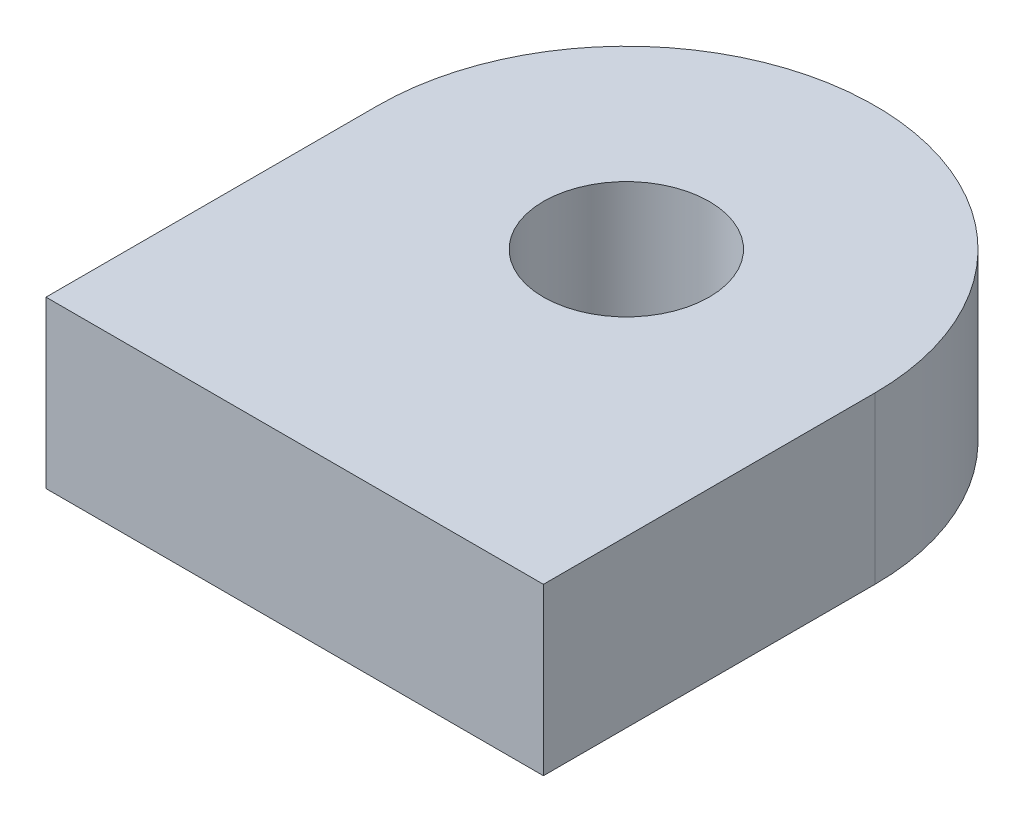
ISO-10303-21;
HEADER;
FILE_DESCRIPTION(('STEP AP214'),'2;1');
FILE_NAME('part.step','',(''),(''),'','','');
FILE_SCHEMA(('AUTOMOTIVE_DESIGN { 1 0 10303 214 1 1 1 1 }'));
ENDSEC;
DATA;
#1=APPLICATION_CONTEXT('core data for automotive mechanical design processes');
#2=APPLICATION_PROTOCOL_DEFINITION('international standard','automotive_design',2000,#1);
#3=PRODUCT_CONTEXT('',#1,'mechanical');
#4=PRODUCT('Part','Part','',(#3));
#5=PRODUCT_RELATED_PRODUCT_CATEGORY('part','',(#4));
#6=PRODUCT_DEFINITION_FORMATION('','',#4);
#7=PRODUCT_DEFINITION_CONTEXT('part definition',#1,'design');
#8=PRODUCT_DEFINITION('design','',#6,#7);
#9=PRODUCT_DEFINITION_SHAPE('','',#8);
#10=(LENGTH_UNIT() NAMED_UNIT(*) SI_UNIT(.MILLI.,.METRE.));
#11=(NAMED_UNIT(*) PLANE_ANGLE_UNIT() SI_UNIT($,.RADIAN.));
#12=(NAMED_UNIT(*) SI_UNIT($,.STERADIAN.) SOLID_ANGLE_UNIT());
#13=UNCERTAINTY_MEASURE_WITH_UNIT(LENGTH_MEASURE(1.E-05),#10,'distance_accuracy_value','');
#14=(GEOMETRIC_REPRESENTATION_CONTEXT(3) GLOBAL_UNCERTAINTY_ASSIGNED_CONTEXT((#13)) GLOBAL_UNIT_ASSIGNED_CONTEXT((#10,
#11,#12)) REPRESENTATION_CONTEXT('',''));
#15=CARTESIAN_POINT('',(0.,0.,0.));
#16=DIRECTION('',(0.,0.,1.));
#17=DIRECTION('',(1.,0.,0.));
#18=AXIS2_PLACEMENT_3D('',#15,#16,#17);
#19=CARTESIAN_POINT('',(0.,12.7,0.));
#20=DIRECTION('',(0.,1.,0.));
#21=DIRECTION('',(0.,0.,1.));
#22=AXIS2_PLACEMENT_3D('',#19,#20,#21);
#23=PLANE('',#22);
#24=CARTESIAN_POINT('',(0.,12.7,0.));
#25=DIRECTION('',(0.,1.,0.));
#26=DIRECTION('',(0.,0.,1.));
#27=AXIS2_PLACEMENT_3D('',#24,#25,#26);
#28=CIRCLE('',#27,19.05);
#29=CARTESIAN_POINT('',(19.05,12.7,0.));
#30=VERTEX_POINT('',#29);
#31=CARTESIAN_POINT('',(-19.05,12.7,0.));
#32=VERTEX_POINT('',#31);
#33=EDGE_CURVE('E86',#30,#32,#28,.T.);
#34=ORIENTED_EDGE('',*,*,#33,.T.);
#35=DIRECTION('',(0.,0.,1.));
#36=VECTOR('',#35,1.);
#37=CARTESIAN_POINT('',(-19.05,12.7,0.));
#38=LINE('',#37,#36);
#39=CARTESIAN_POINT('',(-19.05,12.7,25.4));
#40=VERTEX_POINT('',#39);
#41=EDGE_CURVE('E81',#32,#40,#38,.T.);
#42=ORIENTED_EDGE('',*,*,#41,.T.);
#43=DIRECTION('',(1.,0.,0.));
#44=VECTOR('',#43,1.);
#45=CARTESIAN_POINT('',(-19.05,12.7,25.4));
#46=LINE('',#45,#44);
#47=CARTESIAN_POINT('',(19.05,12.7,25.4));
#48=VERTEX_POINT('',#47);
#49=EDGE_CURVE('E84',#40,#48,#46,.T.);
#50=ORIENTED_EDGE('',*,*,#49,.T.);
#51=DIRECTION('',(0.,0.,-1.));
#52=VECTOR('',#51,1.);
#53=CARTESIAN_POINT('',(19.05,12.7,25.4));
#54=LINE('',#53,#52);
#55=EDGE_CURVE('E51',#48,#30,#54,.T.);
#56=ORIENTED_EDGE('',*,*,#55,.T.);
#57=EDGE_LOOP('',(#34,#42,#50,#56));
#58=FACE_BOUND('',#57,.T.);
#59=CARTESIAN_POINT('',(0.,12.7,0.));
#60=DIRECTION('',(0.,1.,0.));
#61=DIRECTION('',(0.,0.,1.));
#62=AXIS2_PLACEMENT_3D('',#59,#60,#61);
#63=CIRCLE('',#62,6.35);
#64=CARTESIAN_POINT('',(0.,12.7,6.35));
#65=VERTEX_POINT('',#64);
#66=EDGE_CURVE('E101',#65,#65,#63,.T.);
#67=ORIENTED_EDGE('',*,*,#66,.F.);
#68=EDGE_LOOP('',(#67));
#69=FACE_BOUND('',#68,.T.);
#70=ADVANCED_FACE('F34',(#58,#69),#23,.T.);
#71=CARTESIAN_POINT('',(0.,0.,0.));
#72=DIRECTION('',(0.,1.,0.));
#73=DIRECTION('',(0.,0.,1.));
#74=AXIS2_PLACEMENT_3D('',#71,#72,#73);
#75=PLANE('',#74);
#76=CARTESIAN_POINT('',(0.,0.,0.));
#77=DIRECTION('',(0.,1.,0.));
#78=DIRECTION('',(0.,0.,1.));
#79=AXIS2_PLACEMENT_3D('',#76,#77,#78);
#80=CIRCLE('',#79,19.05);
#81=CARTESIAN_POINT('',(19.05,0.,0.));
#82=VERTEX_POINT('',#81);
#83=CARTESIAN_POINT('',(-19.05,0.,0.));
#84=VERTEX_POINT('',#83);
#85=EDGE_CURVE('E98',#82,#84,#80,.T.);
#86=ORIENTED_EDGE('',*,*,#85,.F.);
#87=DIRECTION('',(0.,0.,-1.));
#88=VECTOR('',#87,1.);
#89=CARTESIAN_POINT('',(19.05,0.,25.4));
#90=LINE('',#89,#88);
#91=CARTESIAN_POINT('',(19.05,0.,25.4));
#92=VERTEX_POINT('',#91);
#93=EDGE_CURVE('E74',#92,#82,#90,.T.);
#94=ORIENTED_EDGE('',*,*,#93,.F.);
#95=DIRECTION('',(1.,0.,0.));
#96=VECTOR('',#95,1.);
#97=CARTESIAN_POINT('',(-19.05,0.,25.4));
#98=LINE('',#97,#96);
#99=CARTESIAN_POINT('',(-19.05,0.,25.4));
#100=VERTEX_POINT('',#99);
#101=EDGE_CURVE('E68',#100,#92,#98,.T.);
#102=ORIENTED_EDGE('',*,*,#101,.F.);
#103=DIRECTION('',(0.,0.,1.));
#104=VECTOR('',#103,1.);
#105=CARTESIAN_POINT('',(-19.05,0.,0.));
#106=LINE('',#105,#104);
#107=EDGE_CURVE('E90',#84,#100,#106,.T.);
#108=ORIENTED_EDGE('',*,*,#107,.F.);
#109=EDGE_LOOP('',(#86,#94,#102,#108));
#110=FACE_BOUND('',#109,.T.);
#111=CARTESIAN_POINT('',(0.,0.,0.));
#112=DIRECTION('',(0.,1.,0.));
#113=DIRECTION('',(0.,0.,1.));
#114=AXIS2_PLACEMENT_3D('',#111,#112,#113);
#115=CIRCLE('',#114,6.35);
#116=CARTESIAN_POINT('',(0.,0.,6.35));
#117=VERTEX_POINT('',#116);
#118=EDGE_CURVE('E113',#117,#117,#115,.T.);
#119=ORIENTED_EDGE('',*,*,#118,.T.);
#120=EDGE_LOOP('',(#119));
#121=FACE_BOUND('',#120,.T.);
#122=ADVANCED_FACE('F109',(#110,#121),#75,.F.);
#123=CARTESIAN_POINT('',(0.,12.7,0.));
#124=DIRECTION('',(0.,-1.,0.));
#125=DIRECTION('',(0.,0.,-1.));
#126=AXIS2_PLACEMENT_3D('',#123,#124,#125);
#127=CYLINDRICAL_SURFACE('',#126,19.05);
#128=ORIENTED_EDGE('',*,*,#85,.T.);
#129=DIRECTION('',(0.,-1.,0.));
#130=VECTOR('',#129,1.);
#131=CARTESIAN_POINT('',(-19.05,12.7,0.));
#132=LINE('',#131,#130);
#133=EDGE_CURVE('E11',#32,#84,#132,.T.);
#134=ORIENTED_EDGE('',*,*,#133,.F.);
#135=ORIENTED_EDGE('',*,*,#33,.F.);
#136=DIRECTION('',(0.,-1.,0.));
#137=VECTOR('',#136,1.);
#138=CARTESIAN_POINT('',(19.05,12.7,0.));
#139=LINE('',#138,#137);
#140=EDGE_CURVE('E94',#30,#82,#139,.T.);
#141=ORIENTED_EDGE('',*,*,#140,.T.);
#142=EDGE_LOOP('',(#128,#134,#135,#141));
#143=FACE_BOUND('',#142,.T.);
#144=ADVANCED_FACE('F36',(#143),#127,.T.);
#145=CARTESIAN_POINT('',(-19.05,12.7,0.));
#146=DIRECTION('',(1.,0.,0.));
#147=DIRECTION('',(0.,0.,-1.));
#148=AXIS2_PLACEMENT_3D('',#145,#146,#147);
#149=PLANE('',#148);
#150=ORIENTED_EDGE('',*,*,#107,.T.);
#151=DIRECTION('',(0.,-1.,0.));
#152=VECTOR('',#151,1.);
#153=CARTESIAN_POINT('',(-19.05,12.7,25.4));
#154=LINE('',#153,#152);
#155=EDGE_CURVE('E43',#40,#100,#154,.T.);
#156=ORIENTED_EDGE('',*,*,#155,.F.);
#157=ORIENTED_EDGE('',*,*,#41,.F.);
#158=ORIENTED_EDGE('',*,*,#133,.T.);
#159=EDGE_LOOP('',(#150,#156,#157,#158));
#160=FACE_BOUND('',#159,.T.);
#161=ADVANCED_FACE('F89',(#160),#149,.F.);
#162=CARTESIAN_POINT('',(-19.05,12.7,25.4));
#163=DIRECTION('',(0.,0.,-1.));
#164=DIRECTION('',(-1.,0.,0.));
#165=AXIS2_PLACEMENT_3D('',#162,#163,#164);
#166=PLANE('',#165);
#167=ORIENTED_EDGE('',*,*,#101,.T.);
#168=DIRECTION('',(0.,-1.,0.));
#169=VECTOR('',#168,1.);
#170=CARTESIAN_POINT('',(19.05,12.7,25.4));
#171=LINE('',#170,#169);
#172=EDGE_CURVE('E91',#48,#92,#171,.T.);
#173=ORIENTED_EDGE('',*,*,#172,.F.);
#174=ORIENTED_EDGE('',*,*,#49,.F.);
#175=ORIENTED_EDGE('',*,*,#155,.T.);
#176=EDGE_LOOP('',(#167,#173,#174,#175));
#177=FACE_BOUND('',#176,.T.);
#178=ADVANCED_FACE('F92',(#177),#166,.F.);
#179=CARTESIAN_POINT('',(19.05,12.7,25.4));
#180=DIRECTION('',(-1.,0.,0.));
#181=DIRECTION('',(0.,0.,1.));
#182=AXIS2_PLACEMENT_3D('',#179,#180,#181);
#183=PLANE('',#182);
#184=ORIENTED_EDGE('',*,*,#93,.T.);
#185=ORIENTED_EDGE('',*,*,#140,.F.);
#186=ORIENTED_EDGE('',*,*,#55,.F.);
#187=ORIENTED_EDGE('',*,*,#172,.T.);
#188=EDGE_LOOP('',(#184,#185,#186,#187));
#189=FACE_BOUND('',#188,.T.);
#190=ADVANCED_FACE('F106',(#189),#183,.F.);
#191=CARTESIAN_POINT('',(0.,12.7,0.));
#192=DIRECTION('',(0.,-1.,0.));
#193=DIRECTION('',(0.,0.,-1.));
#194=AXIS2_PLACEMENT_3D('',#191,#192,#193);
#195=CYLINDRICAL_SURFACE('',#194,6.35);
#196=ORIENTED_EDGE('',*,*,#66,.T.);
#197=EDGE_LOOP('',(#196));
#198=FACE_BOUND('',#197,.T.);
#199=ORIENTED_EDGE('',*,*,#118,.F.);
#200=EDGE_LOOP('',(#199));
#201=FACE_BOUND('',#200,.T.);
#202=ADVANCED_FACE('F119',(#198,#201),#195,.F.);
#203=CLOSED_SHELL('',(#70,#122,#144,#161,#178,#190,#202));
#204=MANIFOLD_SOLID_BREP('B2',#203);
#205=ADVANCED_BREP_SHAPE_REPRESENTATION('',(#18,#204),#14);
#206=SHAPE_DEFINITION_REPRESENTATION(#9,#205);
ENDSEC;
END-ISO-10303-21;
